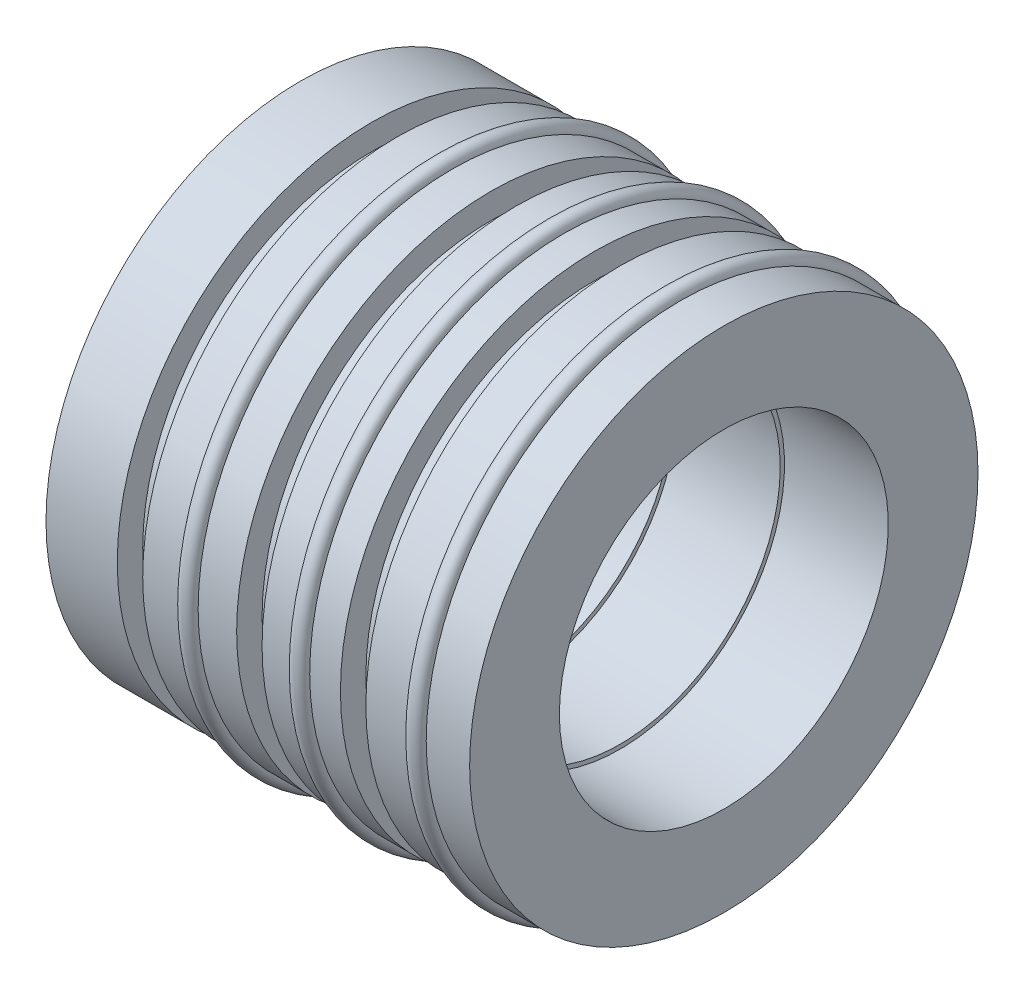
ISO-10303-21;
HEADER;
FILE_DESCRIPTION(('STEP AP214'),'2;1');
FILE_NAME('part.step','',(''),(''),'','','');
FILE_SCHEMA(('AUTOMOTIVE_DESIGN { 1 0 10303 214 1 1 1 1 }'));
ENDSEC;
DATA;
#1=APPLICATION_CONTEXT('core data for automotive mechanical design processes');
#2=APPLICATION_PROTOCOL_DEFINITION('international standard','automotive_design',2000,#1);
#3=PRODUCT_CONTEXT('',#1,'mechanical');
#4=PRODUCT('Part','Part','',(#3));
#5=PRODUCT_RELATED_PRODUCT_CATEGORY('part','',(#4));
#6=PRODUCT_DEFINITION_FORMATION('','',#4);
#7=PRODUCT_DEFINITION_CONTEXT('part definition',#1,'design');
#8=PRODUCT_DEFINITION('design','',#6,#7);
#9=PRODUCT_DEFINITION_SHAPE('','',#8);
#10=(LENGTH_UNIT() NAMED_UNIT(*) SI_UNIT(.MILLI.,.METRE.));
#11=(NAMED_UNIT(*) PLANE_ANGLE_UNIT() SI_UNIT($,.RADIAN.));
#12=(NAMED_UNIT(*) SI_UNIT($,.STERADIAN.) SOLID_ANGLE_UNIT());
#13=UNCERTAINTY_MEASURE_WITH_UNIT(LENGTH_MEASURE(1.E-05),#10,'distance_accuracy_value','');
#14=(GEOMETRIC_REPRESENTATION_CONTEXT(3) GLOBAL_UNCERTAINTY_ASSIGNED_CONTEXT((#13)) GLOBAL_UNIT_ASSIGNED_CONTEXT((#10,
#11,#12)) REPRESENTATION_CONTEXT('',''));
#15=CARTESIAN_POINT('',(0.,0.,0.));
#16=DIRECTION('',(0.,0.,1.));
#17=DIRECTION('',(1.,0.,0.));
#18=AXIS2_PLACEMENT_3D('',#15,#16,#17);
#19=CARTESIAN_POINT('',(0.,0.,0.));
#20=DIRECTION('',(-1.,0.,0.));
#21=DIRECTION('',(0.,0.,1.));
#22=AXIS2_PLACEMENT_3D('',#19,#20,#21);
#23=CYLINDRICAL_SURFACE('',#22,9.352788);
#24=CARTESIAN_POINT('',(19.331996837237,0.,0.));
#25=DIRECTION('',(-1.,0.,0.));
#26=DIRECTION('',(0.,0.,1.));
#27=AXIS2_PLACEMENT_3D('',#24,#25,#26);
#28=CIRCLE('',#27,9.35278799999999);
#29=CARTESIAN_POINT('',(19.331996837237,0.,9.35278799999999));
#30=VERTEX_POINT('',#29);
#31=EDGE_CURVE('E10',#30,#30,#28,.T.);
#32=ORIENTED_EDGE('',*,*,#31,.F.);
#33=EDGE_LOOP('',(#32));
#34=FACE_BOUND('',#33,.T.);
#35=CARTESIAN_POINT('',(6.37799683723705,0.,0.));
#36=DIRECTION('',(-1.,0.,0.));
#37=DIRECTION('',(0.,0.,1.));
#38=AXIS2_PLACEMENT_3D('',#35,#36,#37);
#39=CIRCLE('',#38,9.35278799999999);
#40=CARTESIAN_POINT('',(6.37799683723705,0.,9.35278799999999));
#41=VERTEX_POINT('',#40);
#42=EDGE_CURVE('E119',#41,#41,#39,.T.);
#43=ORIENTED_EDGE('',*,*,#42,.T.);
#44=EDGE_LOOP('',(#43));
#45=FACE_BOUND('',#44,.T.);
#46=ADVANCED_FACE('F37',(#34,#45),#23,.F.);
#47=CARTESIAN_POINT('',(19.331996837237,9.606788,0.));
#48=DIRECTION('',(-1.,0.,0.));
#49=DIRECTION('',(0.,0.,1.));
#50=AXIS2_PLACEMENT_3D('',#47,#48,#49);
#51=PLANE('',#50);
#52=CARTESIAN_POINT('',(19.331996837237,0.,0.));
#53=DIRECTION('',(-1.,0.,0.));
#54=DIRECTION('',(0.,0.,1.));
#55=AXIS2_PLACEMENT_3D('',#52,#53,#54);
#56=CIRCLE('',#55,9.606788);
#57=CARTESIAN_POINT('',(19.331996837237,0.,9.606788));
#58=VERTEX_POINT('',#57);
#59=EDGE_CURVE('E43',#58,#58,#56,.T.);
#60=ORIENTED_EDGE('',*,*,#59,.F.);
#61=EDGE_LOOP('',(#60));
#62=FACE_BOUND('',#61,.T.);
#63=ORIENTED_EDGE('',*,*,#31,.T.);
#64=EDGE_LOOP('',(#63));
#65=FACE_BOUND('',#64,.T.);
#66=ADVANCED_FACE('F264',(#62,#65),#51,.F.);
#67=CARTESIAN_POINT('',(0.,0.,0.));
#68=DIRECTION('',(-1.,0.,0.));
#69=DIRECTION('',(0.,0.,1.));
#70=AXIS2_PLACEMENT_3D('',#67,#68,#69);
#71=CYLINDRICAL_SURFACE('',#70,9.606788);
#72=CARTESIAN_POINT('',(25.554996837237,0.,0.));
#73=DIRECTION('',(-1.,0.,0.));
#74=DIRECTION('',(0.,0.,1.));
#75=AXIS2_PLACEMENT_3D('',#72,#73,#74);
#76=CIRCLE('',#75,9.606788);
#77=CARTESIAN_POINT('',(25.554996837237,0.,9.606788));
#78=VERTEX_POINT('',#77);
#79=EDGE_CURVE('E47',#78,#78,#76,.T.);
#80=ORIENTED_EDGE('',*,*,#79,.F.);
#81=EDGE_LOOP('',(#80));
#82=FACE_BOUND('',#81,.T.);
#83=ORIENTED_EDGE('',*,*,#59,.T.);
#84=EDGE_LOOP('',(#83));
#85=FACE_BOUND('',#84,.T.);
#86=ADVANCED_FACE('F259',(#82,#85),#71,.F.);
#87=CARTESIAN_POINT('',(25.554996837237,9.860788,0.));
#88=DIRECTION('',(-1.,0.,0.));
#89=DIRECTION('',(0.,0.,1.));
#90=AXIS2_PLACEMENT_3D('',#87,#88,#89);
#91=PLANE('',#90);
#92=CARTESIAN_POINT('',(25.554996837237,0.,0.));
#93=DIRECTION('',(-1.,0.,0.));
#94=DIRECTION('',(0.,0.,1.));
#95=AXIS2_PLACEMENT_3D('',#92,#93,#94);
#96=CIRCLE('',#95,9.860788);
#97=CARTESIAN_POINT('',(25.554996837237,0.,9.860788));
#98=VERTEX_POINT('',#97);
#99=EDGE_CURVE('E51',#98,#98,#96,.T.);
#100=ORIENTED_EDGE('',*,*,#99,.F.);
#101=EDGE_LOOP('',(#100));
#102=FACE_BOUND('',#101,.T.);
#103=ORIENTED_EDGE('',*,*,#79,.T.);
#104=EDGE_LOOP('',(#103));
#105=FACE_BOUND('',#104,.T.);
#106=ADVANCED_FACE('F253',(#102,#105),#91,.F.);
#107=CARTESIAN_POINT('',(0.,0.,0.));
#108=DIRECTION('',(-1.,0.,0.));
#109=DIRECTION('',(0.,0.,1.));
#110=AXIS2_PLACEMENT_3D('',#107,#108,#109);
#111=CYLINDRICAL_SURFACE('',#110,9.860788);
#112=CARTESIAN_POINT('',(31.777996837237,0.,0.));
#113=DIRECTION('',(-1.,0.,0.));
#114=DIRECTION('',(0.,0.,1.));
#115=AXIS2_PLACEMENT_3D('',#112,#113,#114);
#116=CIRCLE('',#115,9.860788);
#117=CARTESIAN_POINT('',(31.777996837237,0.,9.860788));
#118=VERTEX_POINT('',#117);
#119=EDGE_CURVE('E56',#118,#118,#116,.T.);
#120=ORIENTED_EDGE('',*,*,#119,.F.);
#121=EDGE_LOOP('',(#120));
#122=FACE_BOUND('',#121,.T.);
#123=ORIENTED_EDGE('',*,*,#99,.T.);
#124=EDGE_LOOP('',(#123));
#125=FACE_BOUND('',#124,.T.);
#126=ADVANCED_FACE('F247',(#122,#125),#111,.F.);
#127=CARTESIAN_POINT('',(31.777996837237,15.24,0.));
#128=DIRECTION('',(-1.,0.,0.));
#129=DIRECTION('',(0.,0.,1.));
#130=AXIS2_PLACEMENT_3D('',#127,#128,#129);
#131=PLANE('',#130);
#132=CARTESIAN_POINT('',(31.777996837237,0.,0.));
#133=DIRECTION('',(-1.,0.,0.));
#134=DIRECTION('',(0.,0.,1.));
#135=AXIS2_PLACEMENT_3D('',#132,#133,#134);
#136=CIRCLE('',#135,15.24);
#137=CARTESIAN_POINT('',(31.777996837237,0.,15.24));
#138=VERTEX_POINT('',#137);
#139=EDGE_CURVE('E59',#138,#138,#136,.T.);
#140=ORIENTED_EDGE('',*,*,#139,.F.);
#141=EDGE_LOOP('',(#140));
#142=FACE_BOUND('',#141,.T.);
#143=ORIENTED_EDGE('',*,*,#119,.T.);
#144=EDGE_LOOP('',(#143));
#145=FACE_BOUND('',#144,.T.);
#146=ADVANCED_FACE('F241',(#142,#145),#131,.F.);
#147=CARTESIAN_POINT('',(0.,0.,0.));
#148=DIRECTION('',(-1.,0.,0.));
#149=DIRECTION('',(0.,0.,1.));
#150=AXIS2_PLACEMENT_3D('',#147,#148,#149);
#151=CYLINDRICAL_SURFACE('',#150,15.24);
#152=CARTESIAN_POINT('',(29.174496837237,0.,0.));
#153=DIRECTION('',(-1.,0.,0.));
#154=DIRECTION('',(0.,0.,1.));
#155=AXIS2_PLACEMENT_3D('',#152,#153,#154);
#156=CIRCLE('',#155,15.24);
#157=CARTESIAN_POINT('',(29.174496837237,0.,15.24));
#158=VERTEX_POINT('',#157);
#159=EDGE_CURVE('E62',#158,#158,#156,.T.);
#160=ORIENTED_EDGE('',*,*,#159,.F.);
#161=EDGE_LOOP('',(#160));
#162=FACE_BOUND('',#161,.T.);
#163=ORIENTED_EDGE('',*,*,#139,.T.);
#164=EDGE_LOOP('',(#163));
#165=FACE_BOUND('',#164,.T.);
#166=ADVANCED_FACE('F235',(#162,#165),#151,.T.);
#167=CARTESIAN_POINT('',(28.666496837237,0.,0.));
#168=DIRECTION('',(-1.,0.,0.));
#169=DIRECTION('',(0.,0.,1.));
#170=AXIS2_PLACEMENT_3D('',#167,#168,#169);
#171=TOROIDAL_SURFACE('',#170,15.24,0.508000000000002);
#172=CARTESIAN_POINT('',(28.158496837237,0.,0.));
#173=DIRECTION('',(-1.,0.,0.));
#174=DIRECTION('',(0.,0.,1.));
#175=AXIS2_PLACEMENT_3D('',#172,#173,#174);
#176=CIRCLE('',#175,15.24);
#177=CARTESIAN_POINT('',(28.158496837237,0.,15.24));
#178=VERTEX_POINT('',#177);
#179=EDGE_CURVE('E65',#178,#178,#176,.T.);
#180=ORIENTED_EDGE('',*,*,#179,.F.);
#181=EDGE_LOOP('',(#180));
#182=FACE_BOUND('',#181,.T.);
#183=ORIENTED_EDGE('',*,*,#159,.T.);
#184=EDGE_LOOP('',(#183));
#185=FACE_BOUND('',#184,.T.);
#186=ADVANCED_FACE('F229',(#182,#185),#171,.T.);
#187=CARTESIAN_POINT('',(0.,0.,0.));
#188=DIRECTION('',(-1.,0.,0.));
#189=DIRECTION('',(0.,0.,1.));
#190=AXIS2_PLACEMENT_3D('',#187,#188,#189);
#191=CYLINDRICAL_SURFACE('',#190,15.24);
#192=CARTESIAN_POINT('',(25.554996837237,0.,0.));
#193=DIRECTION('',(-1.,0.,0.));
#194=DIRECTION('',(0.,0.,1.));
#195=AXIS2_PLACEMENT_3D('',#192,#193,#194);
#196=CIRCLE('',#195,15.24);
#197=CARTESIAN_POINT('',(25.554996837237,0.,15.24));
#198=VERTEX_POINT('',#197);
#199=EDGE_CURVE('E68',#198,#198,#196,.T.);
#200=ORIENTED_EDGE('',*,*,#199,.F.);
#201=EDGE_LOOP('',(#200));
#202=FACE_BOUND('',#201,.T.);
#203=ORIENTED_EDGE('',*,*,#179,.T.);
#204=EDGE_LOOP('',(#203));
#205=FACE_BOUND('',#204,.T.);
#206=ADVANCED_FACE('F223',(#202,#205),#191,.T.);
#207=CARTESIAN_POINT('',(25.554996837237,13.716,0.));
#208=DIRECTION('',(1.,0.,0.));
#209=DIRECTION('',(0.,0.,-1.));
#210=AXIS2_PLACEMENT_3D('',#207,#208,#209);
#211=PLANE('',#210);
#212=CARTESIAN_POINT('',(25.554996837237,0.,0.));
#213=DIRECTION('',(-1.,0.,0.));
#214=DIRECTION('',(0.,0.,1.));
#215=AXIS2_PLACEMENT_3D('',#212,#213,#214);
#216=CIRCLE('',#215,13.716);
#217=CARTESIAN_POINT('',(25.554996837237,0.,13.716));
#218=VERTEX_POINT('',#217);
#219=EDGE_CURVE('E71',#218,#218,#216,.T.);
#220=ORIENTED_EDGE('',*,*,#219,.F.);
#221=EDGE_LOOP('',(#220));
#222=FACE_BOUND('',#221,.T.);
#223=ORIENTED_EDGE('',*,*,#199,.T.);
#224=EDGE_LOOP('',(#223));
#225=FACE_BOUND('',#224,.T.);
#226=ADVANCED_FACE('F217',(#222,#225),#211,.F.);
#227=CARTESIAN_POINT('',(0.,0.,0.));
#228=DIRECTION('',(-1.,0.,0.));
#229=DIRECTION('',(0.,0.,1.));
#230=AXIS2_PLACEMENT_3D('',#227,#228,#229);
#231=CYLINDRICAL_SURFACE('',#230,13.716);
#232=CARTESIAN_POINT('',(24.030996837237,0.,0.));
#233=DIRECTION('',(-1.,0.,0.));
#234=DIRECTION('',(0.,0.,1.));
#235=AXIS2_PLACEMENT_3D('',#232,#233,#234);
#236=CIRCLE('',#235,13.716);
#237=CARTESIAN_POINT('',(24.030996837237,0.,13.716));
#238=VERTEX_POINT('',#237);
#239=EDGE_CURVE('E74',#238,#238,#236,.T.);
#240=ORIENTED_EDGE('',*,*,#239,.F.);
#241=EDGE_LOOP('',(#240));
#242=FACE_BOUND('',#241,.T.);
#243=ORIENTED_EDGE('',*,*,#219,.T.);
#244=EDGE_LOOP('',(#243));
#245=FACE_BOUND('',#244,.T.);
#246=ADVANCED_FACE('F211',(#242,#245),#231,.T.);
#247=CARTESIAN_POINT('',(24.030996837237,15.24,0.));
#248=DIRECTION('',(-1.,0.,0.));
#249=DIRECTION('',(0.,0.,1.));
#250=AXIS2_PLACEMENT_3D('',#247,#248,#249);
#251=PLANE('',#250);
#252=CARTESIAN_POINT('',(24.030996837237,0.,0.));
#253=DIRECTION('',(-1.,0.,0.));
#254=DIRECTION('',(0.,0.,1.));
#255=AXIS2_PLACEMENT_3D('',#252,#253,#254);
#256=CIRCLE('',#255,15.24);
#257=CARTESIAN_POINT('',(24.030996837237,0.,15.24));
#258=VERTEX_POINT('',#257);
#259=EDGE_CURVE('E77',#258,#258,#256,.T.);
#260=ORIENTED_EDGE('',*,*,#259,.F.);
#261=EDGE_LOOP('',(#260));
#262=FACE_BOUND('',#261,.T.);
#263=ORIENTED_EDGE('',*,*,#239,.T.);
#264=EDGE_LOOP('',(#263));
#265=FACE_BOUND('',#264,.T.);
#266=ADVANCED_FACE('F205',(#262,#265),#251,.F.);
#267=CARTESIAN_POINT('',(0.,0.,0.));
#268=DIRECTION('',(-1.,0.,0.));
#269=DIRECTION('',(0.,0.,1.));
#270=AXIS2_PLACEMENT_3D('',#267,#268,#269);
#271=CYLINDRICAL_SURFACE('',#270,15.24);
#272=CARTESIAN_POINT('',(22.189496837237,0.,0.));
#273=DIRECTION('',(-1.,0.,0.));
#274=DIRECTION('',(0.,0.,1.));
#275=AXIS2_PLACEMENT_3D('',#272,#273,#274);
#276=CIRCLE('',#275,15.24);
#277=CARTESIAN_POINT('',(22.189496837237,0.,15.24));
#278=VERTEX_POINT('',#277);
#279=EDGE_CURVE('E80',#278,#278,#276,.T.);
#280=ORIENTED_EDGE('',*,*,#279,.F.);
#281=EDGE_LOOP('',(#280));
#282=FACE_BOUND('',#281,.T.);
#283=ORIENTED_EDGE('',*,*,#259,.T.);
#284=EDGE_LOOP('',(#283));
#285=FACE_BOUND('',#284,.T.);
#286=ADVANCED_FACE('F199',(#282,#285),#271,.T.);
#287=CARTESIAN_POINT('',(21.681496837237,0.,0.));
#288=DIRECTION('',(-1.,0.,0.));
#289=DIRECTION('',(0.,0.,1.));
#290=AXIS2_PLACEMENT_3D('',#287,#288,#289);
#291=TOROIDAL_SURFACE('',#290,15.24,0.508000000000002);
#292=CARTESIAN_POINT('',(21.173496837237,0.,0.));
#293=DIRECTION('',(-1.,0.,0.));
#294=DIRECTION('',(0.,0.,1.));
#295=AXIS2_PLACEMENT_3D('',#292,#293,#294);
#296=CIRCLE('',#295,15.24);
#297=CARTESIAN_POINT('',(21.173496837237,0.,15.24));
#298=VERTEX_POINT('',#297);
#299=EDGE_CURVE('E83',#298,#298,#296,.T.);
#300=ORIENTED_EDGE('',*,*,#299,.F.);
#301=EDGE_LOOP('',(#300));
#302=FACE_BOUND('',#301,.T.);
#303=ORIENTED_EDGE('',*,*,#279,.T.);
#304=EDGE_LOOP('',(#303));
#305=FACE_BOUND('',#304,.T.);
#306=ADVANCED_FACE('F193',(#302,#305),#291,.T.);
#307=CARTESIAN_POINT('',(0.,0.,0.));
#308=DIRECTION('',(-1.,0.,0.));
#309=DIRECTION('',(0.,0.,1.));
#310=AXIS2_PLACEMENT_3D('',#307,#308,#309);
#311=CYLINDRICAL_SURFACE('',#310,15.24);
#312=CARTESIAN_POINT('',(19.331996837237,0.,0.));
#313=DIRECTION('',(-1.,0.,0.));
#314=DIRECTION('',(0.,0.,1.));
#315=AXIS2_PLACEMENT_3D('',#312,#313,#314);
#316=CIRCLE('',#315,15.24);
#317=CARTESIAN_POINT('',(19.331996837237,0.,15.24));
#318=VERTEX_POINT('',#317);
#319=EDGE_CURVE('E86',#318,#318,#316,.T.);
#320=ORIENTED_EDGE('',*,*,#319,.F.);
#321=EDGE_LOOP('',(#320));
#322=FACE_BOUND('',#321,.T.);
#323=ORIENTED_EDGE('',*,*,#299,.T.);
#324=EDGE_LOOP('',(#323));
#325=FACE_BOUND('',#324,.T.);
#326=ADVANCED_FACE('F187',(#322,#325),#311,.T.);
#327=CARTESIAN_POINT('',(19.331996837237,13.716,0.));
#328=DIRECTION('',(1.,0.,0.));
#329=DIRECTION('',(0.,0.,-1.));
#330=AXIS2_PLACEMENT_3D('',#327,#328,#329);
#331=PLANE('',#330);
#332=CARTESIAN_POINT('',(19.331996837237,0.,0.));
#333=DIRECTION('',(-1.,0.,0.));
#334=DIRECTION('',(0.,0.,1.));
#335=AXIS2_PLACEMENT_3D('',#332,#333,#334);
#336=CIRCLE('',#335,13.716);
#337=CARTESIAN_POINT('',(19.331996837237,0.,13.716));
#338=VERTEX_POINT('',#337);
#339=EDGE_CURVE('E89',#338,#338,#336,.T.);
#340=ORIENTED_EDGE('',*,*,#339,.F.);
#341=EDGE_LOOP('',(#340));
#342=FACE_BOUND('',#341,.T.);
#343=ORIENTED_EDGE('',*,*,#319,.T.);
#344=EDGE_LOOP('',(#343));
#345=FACE_BOUND('',#344,.T.);
#346=ADVANCED_FACE('F181',(#342,#345),#331,.F.);
#347=CARTESIAN_POINT('',(0.,0.,0.));
#348=DIRECTION('',(-1.,0.,0.));
#349=DIRECTION('',(0.,0.,1.));
#350=AXIS2_PLACEMENT_3D('',#347,#348,#349);
#351=CYLINDRICAL_SURFACE('',#350,13.716);
#352=CARTESIAN_POINT('',(17.807996837237,0.,0.));
#353=DIRECTION('',(-1.,0.,0.));
#354=DIRECTION('',(0.,0.,1.));
#355=AXIS2_PLACEMENT_3D('',#352,#353,#354);
#356=CIRCLE('',#355,13.716);
#357=CARTESIAN_POINT('',(17.807996837237,0.,13.716));
#358=VERTEX_POINT('',#357);
#359=EDGE_CURVE('E92',#358,#358,#356,.T.);
#360=ORIENTED_EDGE('',*,*,#359,.F.);
#361=EDGE_LOOP('',(#360));
#362=FACE_BOUND('',#361,.T.);
#363=ORIENTED_EDGE('',*,*,#339,.T.);
#364=EDGE_LOOP('',(#363));
#365=FACE_BOUND('',#364,.T.);
#366=ADVANCED_FACE('F175',(#362,#365),#351,.T.);
#367=CARTESIAN_POINT('',(17.807996837237,15.24,0.));
#368=DIRECTION('',(-1.,0.,0.));
#369=DIRECTION('',(0.,0.,1.));
#370=AXIS2_PLACEMENT_3D('',#367,#368,#369);
#371=PLANE('',#370);
#372=CARTESIAN_POINT('',(17.807996837237,0.,0.));
#373=DIRECTION('',(-1.,0.,0.));
#374=DIRECTION('',(0.,0.,1.));
#375=AXIS2_PLACEMENT_3D('',#372,#373,#374);
#376=CIRCLE('',#375,15.24);
#377=CARTESIAN_POINT('',(17.807996837237,0.,15.24));
#378=VERTEX_POINT('',#377);
#379=EDGE_CURVE('E95',#378,#378,#376,.T.);
#380=ORIENTED_EDGE('',*,*,#379,.F.);
#381=EDGE_LOOP('',(#380));
#382=FACE_BOUND('',#381,.T.);
#383=ORIENTED_EDGE('',*,*,#359,.T.);
#384=EDGE_LOOP('',(#383));
#385=FACE_BOUND('',#384,.T.);
#386=ADVANCED_FACE('F169',(#382,#385),#371,.F.);
#387=CARTESIAN_POINT('',(0.,0.,0.));
#388=DIRECTION('',(-1.,0.,0.));
#389=DIRECTION('',(0.,0.,1.));
#390=AXIS2_PLACEMENT_3D('',#387,#388,#389);
#391=CYLINDRICAL_SURFACE('',#390,15.24);
#392=CARTESIAN_POINT('',(15.5001165806001,0.,0.));
#393=DIRECTION('',(-1.,0.,0.));
#394=DIRECTION('',(0.,0.,1.));
#395=AXIS2_PLACEMENT_3D('',#392,#393,#394);
#396=CIRCLE('',#395,15.24);
#397=CARTESIAN_POINT('',(15.5001165806001,0.,15.24));
#398=VERTEX_POINT('',#397);
#399=EDGE_CURVE('E98',#398,#398,#396,.T.);
#400=ORIENTED_EDGE('',*,*,#399,.F.);
#401=EDGE_LOOP('',(#400));
#402=FACE_BOUND('',#401,.T.);
#403=ORIENTED_EDGE('',*,*,#379,.T.);
#404=EDGE_LOOP('',(#403));
#405=FACE_BOUND('',#404,.T.);
#406=ADVANCED_FACE('F163',(#402,#405),#391,.T.);
#407=CARTESIAN_POINT('',(14.9921165806001,0.,0.));
#408=DIRECTION('',(-1.,0.,0.));
#409=DIRECTION('',(0.,0.,1.));
#410=AXIS2_PLACEMENT_3D('',#407,#408,#409);
#411=TOROIDAL_SURFACE('',#410,15.24,0.508);
#412=CARTESIAN_POINT('',(14.4841165806001,0.,0.));
#413=DIRECTION('',(-1.,0.,0.));
#414=DIRECTION('',(0.,0.,1.));
#415=AXIS2_PLACEMENT_3D('',#412,#413,#414);
#416=CIRCLE('',#415,15.24);
#417=CARTESIAN_POINT('',(14.4841165806001,0.,15.24));
#418=VERTEX_POINT('',#417);
#419=EDGE_CURVE('E101',#418,#418,#416,.T.);
#420=ORIENTED_EDGE('',*,*,#419,.F.);
#421=EDGE_LOOP('',(#420));
#422=FACE_BOUND('',#421,.T.);
#423=ORIENTED_EDGE('',*,*,#399,.T.);
#424=EDGE_LOOP('',(#423));
#425=FACE_BOUND('',#424,.T.);
#426=ADVANCED_FACE('F157',(#422,#425),#411,.T.);
#427=CARTESIAN_POINT('',(0.,0.,0.));
#428=DIRECTION('',(-1.,0.,0.));
#429=DIRECTION('',(0.,0.,1.));
#430=AXIS2_PLACEMENT_3D('',#427,#428,#429);
#431=CYLINDRICAL_SURFACE('',#430,15.24);
#432=CARTESIAN_POINT('',(12.1762363239632,0.,0.));
#433=DIRECTION('',(-1.,0.,0.));
#434=DIRECTION('',(0.,0.,1.));
#435=AXIS2_PLACEMENT_3D('',#432,#433,#434);
#436=CIRCLE('',#435,15.24);
#437=CARTESIAN_POINT('',(12.1762363239632,0.,15.24));
#438=VERTEX_POINT('',#437);
#439=EDGE_CURVE('E104',#438,#438,#436,.T.);
#440=ORIENTED_EDGE('',*,*,#439,.F.);
#441=EDGE_LOOP('',(#440));
#442=FACE_BOUND('',#441,.T.);
#443=ORIENTED_EDGE('',*,*,#419,.T.);
#444=EDGE_LOOP('',(#443));
#445=FACE_BOUND('',#444,.T.);
#446=ADVANCED_FACE('F151',(#442,#445),#431,.T.);
#447=CARTESIAN_POINT('',(12.1762363239632,13.716,0.));
#448=DIRECTION('',(1.,0.,0.));
#449=DIRECTION('',(0.,0.,-1.));
#450=AXIS2_PLACEMENT_3D('',#447,#448,#449);
#451=PLANE('',#450);
#452=CARTESIAN_POINT('',(12.1762363239632,0.,0.));
#453=DIRECTION('',(-1.,0.,0.));
#454=DIRECTION('',(0.,0.,1.));
#455=AXIS2_PLACEMENT_3D('',#452,#453,#454);
#456=CIRCLE('',#455,13.716);
#457=CARTESIAN_POINT('',(12.1762363239632,0.,13.716));
#458=VERTEX_POINT('',#457);
#459=EDGE_CURVE('E107',#458,#458,#456,.T.);
#460=ORIENTED_EDGE('',*,*,#459,.F.);
#461=EDGE_LOOP('',(#460));
#462=FACE_BOUND('',#461,.T.);
#463=ORIENTED_EDGE('',*,*,#439,.T.);
#464=EDGE_LOOP('',(#463));
#465=FACE_BOUND('',#464,.T.);
#466=ADVANCED_FACE('F145',(#462,#465),#451,.F.);
#467=CARTESIAN_POINT('',(0.,0.,0.));
#468=DIRECTION('',(-1.,0.,0.));
#469=DIRECTION('',(0.,0.,1.));
#470=AXIS2_PLACEMENT_3D('',#467,#468,#469);
#471=CYLINDRICAL_SURFACE('',#470,13.716);
#472=CARTESIAN_POINT('',(10.6522363239632,0.,0.));
#473=DIRECTION('',(-1.,0.,0.));
#474=DIRECTION('',(0.,0.,1.));
#475=AXIS2_PLACEMENT_3D('',#472,#473,#474);
#476=CIRCLE('',#475,13.716);
#477=CARTESIAN_POINT('',(10.6522363239632,0.,13.716));
#478=VERTEX_POINT('',#477);
#479=EDGE_CURVE('E110',#478,#478,#476,.T.);
#480=ORIENTED_EDGE('',*,*,#479,.F.);
#481=EDGE_LOOP('',(#480));
#482=FACE_BOUND('',#481,.T.);
#483=ORIENTED_EDGE('',*,*,#459,.T.);
#484=EDGE_LOOP('',(#483));
#485=FACE_BOUND('',#484,.T.);
#486=ADVANCED_FACE('F139',(#482,#485),#471,.T.);
#487=CARTESIAN_POINT('',(10.6522363239632,15.24,0.));
#488=DIRECTION('',(-1.,0.,0.));
#489=DIRECTION('',(0.,0.,1.));
#490=AXIS2_PLACEMENT_3D('',#487,#488,#489);
#491=PLANE('',#490);
#492=CARTESIAN_POINT('',(10.6522363239632,0.,0.));
#493=DIRECTION('',(-1.,0.,0.));
#494=DIRECTION('',(0.,0.,1.));
#495=AXIS2_PLACEMENT_3D('',#492,#493,#494);
#496=CIRCLE('',#495,15.24);
#497=CARTESIAN_POINT('',(10.6522363239632,0.,15.24));
#498=VERTEX_POINT('',#497);
#499=EDGE_CURVE('E113',#498,#498,#496,.T.);
#500=ORIENTED_EDGE('',*,*,#499,.F.);
#501=EDGE_LOOP('',(#500));
#502=FACE_BOUND('',#501,.T.);
#503=ORIENTED_EDGE('',*,*,#479,.T.);
#504=EDGE_LOOP('',(#503));
#505=FACE_BOUND('',#504,.T.);
#506=ADVANCED_FACE('F133',(#502,#505),#491,.F.);
#507=CARTESIAN_POINT('',(0.,0.,0.));
#508=DIRECTION('',(-1.,0.,0.));
#509=DIRECTION('',(0.,0.,1.));
#510=AXIS2_PLACEMENT_3D('',#507,#508,#509);
#511=CYLINDRICAL_SURFACE('',#510,15.24);
#512=CARTESIAN_POINT('',(6.37799683723705,0.,0.));
#513=DIRECTION('',(-1.,0.,0.));
#514=DIRECTION('',(0.,0.,1.));
#515=AXIS2_PLACEMENT_3D('',#512,#513,#514);
#516=CIRCLE('',#515,15.24);
#517=CARTESIAN_POINT('',(6.37799683723705,0.,15.24));
#518=VERTEX_POINT('',#517);
#519=EDGE_CURVE('E116',#518,#518,#516,.T.);
#520=ORIENTED_EDGE('',*,*,#519,.F.);
#521=EDGE_LOOP('',(#520));
#522=FACE_BOUND('',#521,.T.);
#523=ORIENTED_EDGE('',*,*,#499,.T.);
#524=EDGE_LOOP('',(#523));
#525=FACE_BOUND('',#524,.T.);
#526=ADVANCED_FACE('F127',(#522,#525),#511,.T.);
#527=CARTESIAN_POINT('',(6.37799683723705,9.35278799999999,0.));
#528=DIRECTION('',(1.,0.,0.));
#529=DIRECTION('',(0.,0.,-1.));
#530=AXIS2_PLACEMENT_3D('',#527,#528,#529);
#531=PLANE('',#530);
#532=ORIENTED_EDGE('',*,*,#42,.F.);
#533=EDGE_LOOP('',(#532));
#534=FACE_BOUND('',#533,.T.);
#535=ORIENTED_EDGE('',*,*,#519,.T.);
#536=EDGE_LOOP('',(#535));
#537=FACE_BOUND('',#536,.T.);
#538=ADVANCED_FACE('F124',(#534,#537),#531,.F.);
#539=CLOSED_SHELL('',(#46,#66,#86,#106,#126,#146,#166,#186,#206,#226,#246,#266,#286,#306,#326,
#346,#366,#386,#406,#426,#446,#466,#486,#506,#526,#538));
#540=MANIFOLD_SOLID_BREP('B2',#539);
#541=ADVANCED_BREP_SHAPE_REPRESENTATION('',(#18,#540),#14);
#542=SHAPE_DEFINITION_REPRESENTATION(#9,#541);
ENDSEC;
END-ISO-10303-21;
